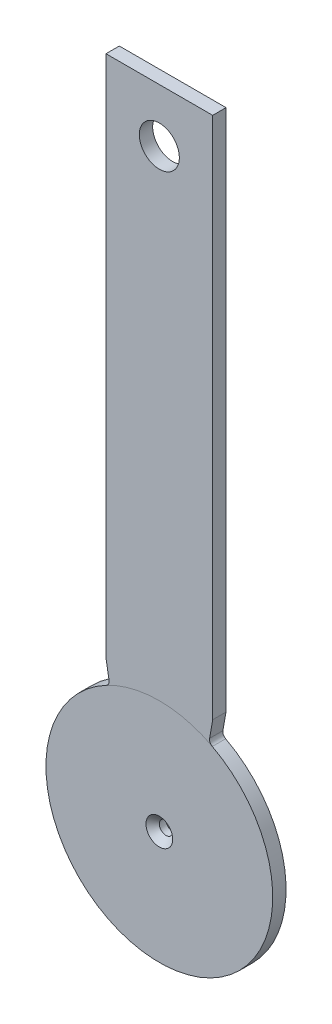
ISO-10303-21;
HEADER;
FILE_DESCRIPTION(('STEP AP214'),'2;1');
FILE_NAME('part.step','',(''),(''),'','','');
FILE_SCHEMA(('AUTOMOTIVE_DESIGN { 1 0 10303 214 1 1 1 1 }'));
ENDSEC;
DATA;
#1=APPLICATION_CONTEXT('core data for automotive mechanical design processes');
#2=APPLICATION_PROTOCOL_DEFINITION('international standard','automotive_design',2000,#1);
#3=PRODUCT_CONTEXT('',#1,'mechanical');
#4=PRODUCT('Part','Part','',(#3));
#5=PRODUCT_RELATED_PRODUCT_CATEGORY('part','',(#4));
#6=PRODUCT_DEFINITION_FORMATION('','',#4);
#7=PRODUCT_DEFINITION_CONTEXT('part definition',#1,'design');
#8=PRODUCT_DEFINITION('design','',#6,#7);
#9=PRODUCT_DEFINITION_SHAPE('','',#8);
#10=(LENGTH_UNIT() NAMED_UNIT(*) SI_UNIT(.MILLI.,.METRE.));
#11=(NAMED_UNIT(*) PLANE_ANGLE_UNIT() SI_UNIT($,.RADIAN.));
#12=(NAMED_UNIT(*) SI_UNIT($,.STERADIAN.) SOLID_ANGLE_UNIT());
#13=UNCERTAINTY_MEASURE_WITH_UNIT(LENGTH_MEASURE(1.E-05),#10,'distance_accuracy_value','');
#14=(GEOMETRIC_REPRESENTATION_CONTEXT(3) GLOBAL_UNCERTAINTY_ASSIGNED_CONTEXT((#13)) GLOBAL_UNIT_ASSIGNED_CONTEXT((#10,
#11,#12)) REPRESENTATION_CONTEXT('',''));
#15=CARTESIAN_POINT('',(0.,0.,0.));
#16=DIRECTION('',(0.,0.,1.));
#17=DIRECTION('',(1.,0.,0.));
#18=AXIS2_PLACEMENT_3D('',#15,#16,#17);
#19=CARTESIAN_POINT('',(13.208,24.9806933900963,1.5875));
#20=DIRECTION('',(0.,0.,1.));
#21=DIRECTION('',(1.,0.,0.));
#22=AXIS2_PLACEMENT_3D('',#19,#20,#21);
#23=PLANE('',#22);
#24=CARTESIAN_POINT('',(0.,141.2875,1.5875));
#25=DIRECTION('',(0.,0.,1.));
#26=DIRECTION('',(1.,0.,0.));
#27=AXIS2_PLACEMENT_3D('',#24,#25,#26);
#28=CIRCLE('',#27,4.76249999999999);
#29=CARTESIAN_POINT('',(4.76249999999999,141.2875,1.5875));
#30=VERTEX_POINT('',#29);
#31=EDGE_CURVE('E124',#30,#30,#28,.T.);
#32=ORIENTED_EDGE('',*,*,#31,.F.);
#33=EDGE_LOOP('',(#32));
#34=FACE_BOUND('',#33,.T.);
#35=CARTESIAN_POINT('',(-13.208,24.9806933900963,1.5875));
#36=DIRECTION('',(0.,0.,-1.));
#37=DIRECTION('',(-1.,0.,0.));
#38=AXIS2_PLACEMENT_3D('',#35,#36,#37);
#39=CIRCLE('',#38,1.27);
#40=CARTESIAN_POINT('',(-11.9572941536745,25.2012265757333,1.5875));
#41=VERTEX_POINT('',#40);
#42=CARTESIAN_POINT('',(-12.6143820224719,23.857965597283,1.5875));
#43=VERTEX_POINT('',#42);
#44=EDGE_CURVE('E136',#41,#43,#39,.T.);
#45=ORIENTED_EDGE('',*,*,#44,.T.);
#46=CARTESIAN_POINT('',(0.,0.,1.5875));
#47=DIRECTION('',(0.,0.,1.));
#48=DIRECTION('',(1.,0.,0.));
#49=AXIS2_PLACEMENT_3D('',#46,#47,#48);
#50=CIRCLE('',#49,26.9875);
#51=CARTESIAN_POINT('',(12.6143820224719,23.857965597283,1.5875));
#52=VERTEX_POINT('',#51);
#53=EDGE_CURVE('E11',#43,#52,#50,.F.);
#54=ORIENTED_EDGE('',*,*,#53,.T.);
#55=CARTESIAN_POINT('',(13.208,24.9806933900963,1.5875));
#56=DIRECTION('',(0.,0.,-1.));
#57=DIRECTION('',(1.,0.,0.));
#58=AXIS2_PLACEMENT_3D('',#55,#56,#57);
#59=CIRCLE('',#58,1.27);
#60=CARTESIAN_POINT('',(11.9572941536745,25.2012265757333,1.5875));
#61=VERTEX_POINT('',#60);
#62=EDGE_CURVE('E123',#52,#61,#59,.T.);
#63=ORIENTED_EDGE('',*,*,#62,.T.);
#64=DIRECTION('',(0.173648177666931,0.984807753012208,0.));
#65=VECTOR('',#64,1.);
#66=CARTESIAN_POINT('',(12.7,29.4133207393231,1.5875));
#67=LINE('',#66,#65);
#68=CARTESIAN_POINT('',(12.7,29.4133207393231,1.5875));
#69=VERTEX_POINT('',#68);
#70=EDGE_CURVE('E104',#61,#69,#67,.T.);
#71=ORIENTED_EDGE('',*,*,#70,.T.);
#72=DIRECTION('',(0.,1.,0.));
#73=VECTOR('',#72,1.);
#74=CARTESIAN_POINT('',(12.7,153.9875,1.5875));
#75=LINE('',#74,#73);
#76=CARTESIAN_POINT('',(12.7,153.9875,1.5875));
#77=VERTEX_POINT('',#76);
#78=EDGE_CURVE('E113',#69,#77,#75,.T.);
#79=ORIENTED_EDGE('',*,*,#78,.T.);
#80=DIRECTION('',(-1.,0.,0.));
#81=VECTOR('',#80,1.);
#82=CARTESIAN_POINT('',(-12.7,153.9875,1.5875));
#83=LINE('',#82,#81);
#84=CARTESIAN_POINT('',(-12.7,153.9875,1.5875));
#85=VERTEX_POINT('',#84);
#86=EDGE_CURVE('E118',#77,#85,#83,.T.);
#87=ORIENTED_EDGE('',*,*,#86,.T.);
#88=DIRECTION('',(0.,-1.,0.));
#89=VECTOR('',#88,1.);
#90=CARTESIAN_POINT('',(-12.7,29.4133207393231,1.5875));
#91=LINE('',#90,#89);
#92=CARTESIAN_POINT('',(-12.7,29.4133207393231,1.5875));
#93=VERTEX_POINT('',#92);
#94=EDGE_CURVE('E130',#85,#93,#91,.T.);
#95=ORIENTED_EDGE('',*,*,#94,.T.);
#96=DIRECTION('',(0.173648177666923,-0.984807753012209,0.));
#97=VECTOR('',#96,1.);
#98=CARTESIAN_POINT('',(-12.7,29.4133207393231,1.5875));
#99=LINE('',#98,#97);
#100=EDGE_CURVE('E133',#93,#41,#99,.T.);
#101=ORIENTED_EDGE('',*,*,#100,.T.);
#102=EDGE_LOOP('',(#45,#54,#63,#71,#79,#87,#95,#101));
#103=FACE_BOUND('',#102,.T.);
#104=ADVANCED_FACE('F38',(#34,#103),#23,.T.);
#105=CARTESIAN_POINT('',(13.208,24.9806933900963,-1.5875));
#106=DIRECTION('',(0.,0.,1.));
#107=DIRECTION('',(1.,0.,0.));
#108=AXIS2_PLACEMENT_3D('',#105,#106,#107);
#109=PLANE('',#108);
#110=CARTESIAN_POINT('',(0.,141.2875,-1.5875));
#111=DIRECTION('',(0.,0.,1.));
#112=DIRECTION('',(1.,0.,0.));
#113=AXIS2_PLACEMENT_3D('',#110,#111,#112);
#114=CIRCLE('',#113,4.76249999999999);
#115=CARTESIAN_POINT('',(4.76249999999999,141.2875,-1.5875));
#116=VERTEX_POINT('',#115);
#117=EDGE_CURVE('E142',#116,#116,#114,.T.);
#118=ORIENTED_EDGE('',*,*,#117,.T.);
#119=EDGE_LOOP('',(#118));
#120=FACE_BOUND('',#119,.T.);
#121=CARTESIAN_POINT('',(0.,0.,-1.5875));
#122=DIRECTION('',(0.,0.,1.));
#123=DIRECTION('',(1.,0.,0.));
#124=AXIS2_PLACEMENT_3D('',#121,#122,#123);
#125=CIRCLE('',#124,26.9875);
#126=CARTESIAN_POINT('',(-12.6143820224719,23.857965597283,-1.5875));
#127=VERTEX_POINT('',#126);
#128=CARTESIAN_POINT('',(12.6143820224719,23.857965597283,-1.5875));
#129=VERTEX_POINT('',#128);
#130=EDGE_CURVE('E42',#127,#129,#125,.F.);
#131=ORIENTED_EDGE('',*,*,#130,.F.);
#132=CARTESIAN_POINT('',(-13.208,24.9806933900963,-1.5875));
#133=DIRECTION('',(0.,0.,-1.));
#134=DIRECTION('',(-1.,0.,0.));
#135=AXIS2_PLACEMENT_3D('',#132,#133,#134);
#136=CIRCLE('',#135,1.27);
#137=CARTESIAN_POINT('',(-11.9572941536745,25.2012265757333,-1.5875));
#138=VERTEX_POINT('',#137);
#139=EDGE_CURVE('E160',#138,#127,#136,.T.);
#140=ORIENTED_EDGE('',*,*,#139,.F.);
#141=DIRECTION('',(0.173648177666923,-0.984807753012209,0.));
#142=VECTOR('',#141,1.);
#143=CARTESIAN_POINT('',(-12.7,29.4133207393231,-1.5875));
#144=LINE('',#143,#142);
#145=CARTESIAN_POINT('',(-12.7,29.4133207393231,-1.5875));
#146=VERTEX_POINT('',#145);
#147=EDGE_CURVE('E157',#146,#138,#144,.T.);
#148=ORIENTED_EDGE('',*,*,#147,.F.);
#149=DIRECTION('',(0.,-1.,0.));
#150=VECTOR('',#149,1.);
#151=CARTESIAN_POINT('',(-12.7,29.4133207393231,-1.5875));
#152=LINE('',#151,#150);
#153=CARTESIAN_POINT('',(-12.7,153.9875,-1.5875));
#154=VERTEX_POINT('',#153);
#155=EDGE_CURVE('E154',#154,#146,#152,.T.);
#156=ORIENTED_EDGE('',*,*,#155,.F.);
#157=DIRECTION('',(-1.,0.,0.));
#158=VECTOR('',#157,1.);
#159=CARTESIAN_POINT('',(-12.7,153.9875,-1.5875));
#160=LINE('',#159,#158);
#161=CARTESIAN_POINT('',(12.7,153.9875,-1.5875));
#162=VERTEX_POINT('',#161);
#163=EDGE_CURVE('E151',#162,#154,#160,.T.);
#164=ORIENTED_EDGE('',*,*,#163,.F.);
#165=DIRECTION('',(0.,1.,0.));
#166=VECTOR('',#165,1.);
#167=CARTESIAN_POINT('',(12.7,153.9875,-1.5875));
#168=LINE('',#167,#166);
#169=CARTESIAN_POINT('',(12.7,29.4133207393231,-1.5875));
#170=VERTEX_POINT('',#169);
#171=EDGE_CURVE('E149',#170,#162,#168,.T.);
#172=ORIENTED_EDGE('',*,*,#171,.F.);
#173=DIRECTION('',(0.173648177666931,0.984807753012208,0.));
#174=VECTOR('',#173,1.);
#175=CARTESIAN_POINT('',(12.7,29.4133207393231,-1.5875));
#176=LINE('',#175,#174);
#177=CARTESIAN_POINT('',(11.9572941536745,25.2012265757333,-1.5875));
#178=VERTEX_POINT('',#177);
#179=EDGE_CURVE('E105',#178,#170,#176,.T.);
#180=ORIENTED_EDGE('',*,*,#179,.F.);
#181=CARTESIAN_POINT('',(13.208,24.9806933900963,-1.5875));
#182=DIRECTION('',(0.,0.,-1.));
#183=DIRECTION('',(1.,0.,0.));
#184=AXIS2_PLACEMENT_3D('',#181,#182,#183);
#185=CIRCLE('',#184,1.27);
#186=EDGE_CURVE('E110',#129,#178,#185,.T.);
#187=ORIENTED_EDGE('',*,*,#186,.F.);
#188=EDGE_LOOP('',(#131,#140,#148,#156,#164,#172,#180,#187));
#189=FACE_BOUND('',#188,.T.);
#190=ADVANCED_FACE('F210',(#120,#189),#109,.F.);
#191=CARTESIAN_POINT('',(12.7,29.4133207393231,-1.5875));
#192=DIRECTION('',(0.984807753012208,-0.173648177666931,0.));
#193=DIRECTION('',(0.173648177666931,0.984807753012208,0.));
#194=AXIS2_PLACEMENT_3D('',#191,#192,#193);
#195=PLANE('',#194);
#196=DIRECTION('',(0.,0.,1.));
#197=VECTOR('',#196,1.);
#198=CARTESIAN_POINT('',(12.7,29.4133207393231,-1.5875));
#199=LINE('',#198,#197);
#200=EDGE_CURVE('E100',#170,#69,#199,.T.);
#201=ORIENTED_EDGE('',*,*,#200,.T.);
#202=ORIENTED_EDGE('',*,*,#70,.F.);
#203=DIRECTION('',(0.,0.,1.));
#204=VECTOR('',#203,1.);
#205=CARTESIAN_POINT('',(11.9572941536745,25.2012265757333,-1.5875));
#206=LINE('',#205,#204);
#207=EDGE_CURVE('E54',#178,#61,#206,.T.);
#208=ORIENTED_EDGE('',*,*,#207,.F.);
#209=ORIENTED_EDGE('',*,*,#179,.T.);
#210=EDGE_LOOP('',(#201,#202,#208,#209));
#211=FACE_BOUND('',#210,.T.);
#212=ADVANCED_FACE('F102',(#211),#195,.T.);
#213=CARTESIAN_POINT('',(13.208,24.9806933900963,-1.5875));
#214=DIRECTION('',(0.,0.,1.));
#215=DIRECTION('',(1.,0.,0.));
#216=AXIS2_PLACEMENT_3D('',#213,#214,#215);
#217=CYLINDRICAL_SURFACE('',#216,1.27);
#218=ORIENTED_EDGE('',*,*,#207,.T.);
#219=ORIENTED_EDGE('',*,*,#62,.F.);
#220=DIRECTION('',(0.,0.,1.));
#221=VECTOR('',#220,1.);
#222=CARTESIAN_POINT('',(12.6143820224719,23.857965597283,-1.5875));
#223=LINE('',#222,#221);
#224=EDGE_CURVE('E170',#129,#52,#223,.T.);
#225=ORIENTED_EDGE('',*,*,#224,.F.);
#226=ORIENTED_EDGE('',*,*,#186,.T.);
#227=EDGE_LOOP('',(#218,#219,#225,#226));
#228=FACE_BOUND('',#227,.T.);
#229=ADVANCED_FACE('F231',(#228),#217,.F.);
#230=CARTESIAN_POINT('',(0.,0.,-1.5875));
#231=DIRECTION('',(0.,0.,1.));
#232=DIRECTION('',(1.,0.,0.));
#233=AXIS2_PLACEMENT_3D('',#230,#231,#232);
#234=CYLINDRICAL_SURFACE('',#233,26.9875);
#235=ORIENTED_EDGE('',*,*,#224,.T.);
#236=CARTESIAN_POINT('',(0.,0.,1.5875));
#237=DIRECTION('',(0.,0.,1.));
#238=DIRECTION('',(1.,0.,0.));
#239=AXIS2_PLACEMENT_3D('',#236,#237,#238);
#240=CIRCLE('',#239,26.9875);
#241=EDGE_CURVE('E138',#43,#52,#240,.T.);
#242=ORIENTED_EDGE('',*,*,#241,.F.);
#243=DIRECTION('',(0.,0.,1.));
#244=VECTOR('',#243,1.);
#245=CARTESIAN_POINT('',(-12.6143820224719,23.857965597283,-1.5875));
#246=LINE('',#245,#244);
#247=EDGE_CURVE('E173',#127,#43,#246,.T.);
#248=ORIENTED_EDGE('',*,*,#247,.F.);
#249=CARTESIAN_POINT('',(0.,0.,-1.5875));
#250=DIRECTION('',(0.,0.,1.));
#251=DIRECTION('',(1.,0.,0.));
#252=AXIS2_PLACEMENT_3D('',#249,#250,#251);
#253=CIRCLE('',#252,26.9875);
#254=EDGE_CURVE('E163',#127,#129,#253,.T.);
#255=ORIENTED_EDGE('',*,*,#254,.T.);
#256=EDGE_LOOP('',(#235,#242,#248,#255));
#257=FACE_BOUND('',#256,.T.);
#258=ADVANCED_FACE('F233',(#257),#234,.T.);
#259=CARTESIAN_POINT('',(-13.208,24.9806933900963,-1.5875));
#260=DIRECTION('',(0.,0.,1.));
#261=DIRECTION('',(1.,0.,0.));
#262=AXIS2_PLACEMENT_3D('',#259,#260,#261);
#263=CYLINDRICAL_SURFACE('',#262,1.27);
#264=ORIENTED_EDGE('',*,*,#247,.T.);
#265=ORIENTED_EDGE('',*,*,#44,.F.);
#266=DIRECTION('',(0.,0.,1.));
#267=VECTOR('',#266,1.);
#268=CARTESIAN_POINT('',(-11.9572941536745,25.2012265757333,-1.5875));
#269=LINE('',#268,#267);
#270=EDGE_CURVE('E176',#138,#41,#269,.T.);
#271=ORIENTED_EDGE('',*,*,#270,.F.);
#272=ORIENTED_EDGE('',*,*,#139,.T.);
#273=EDGE_LOOP('',(#264,#265,#271,#272));
#274=FACE_BOUND('',#273,.T.);
#275=ADVANCED_FACE('F216',(#274),#263,.F.);
#276=CARTESIAN_POINT('',(-12.7,29.4133207393231,-1.5875));
#277=DIRECTION('',(-0.984807753012209,-0.173648177666923,0.));
#278=DIRECTION('',(0.173648177666923,-0.98480775301221,0.));
#279=AXIS2_PLACEMENT_3D('',#276,#277,#278);
#280=PLANE('',#279);
#281=ORIENTED_EDGE('',*,*,#270,.T.);
#282=ORIENTED_EDGE('',*,*,#100,.F.);
#283=DIRECTION('',(0.,0.,1.));
#284=VECTOR('',#283,1.);
#285=CARTESIAN_POINT('',(-12.7,29.4133207393231,-1.5875));
#286=LINE('',#285,#284);
#287=EDGE_CURVE('E178',#146,#93,#286,.T.);
#288=ORIENTED_EDGE('',*,*,#287,.F.);
#289=ORIENTED_EDGE('',*,*,#147,.T.);
#290=EDGE_LOOP('',(#281,#282,#288,#289));
#291=FACE_BOUND('',#290,.T.);
#292=ADVANCED_FACE('F222',(#291),#280,.T.);
#293=CARTESIAN_POINT('',(-12.7,29.4133207393231,-1.5875));
#294=DIRECTION('',(-1.,0.,0.));
#295=DIRECTION('',(0.,0.,1.));
#296=AXIS2_PLACEMENT_3D('',#293,#294,#295);
#297=PLANE('',#296);
#298=ORIENTED_EDGE('',*,*,#287,.T.);
#299=ORIENTED_EDGE('',*,*,#94,.F.);
#300=DIRECTION('',(0.,0.,1.));
#301=VECTOR('',#300,1.);
#302=CARTESIAN_POINT('',(-12.7,153.9875,-1.5875));
#303=LINE('',#302,#301);
#304=EDGE_CURVE('E180',#154,#85,#303,.T.);
#305=ORIENTED_EDGE('',*,*,#304,.F.);
#306=ORIENTED_EDGE('',*,*,#155,.T.);
#307=EDGE_LOOP('',(#298,#299,#305,#306));
#308=FACE_BOUND('',#307,.T.);
#309=ADVANCED_FACE('F226',(#308),#297,.T.);
#310=CARTESIAN_POINT('',(-12.7,153.9875,-1.5875));
#311=DIRECTION('',(0.,1.,0.));
#312=DIRECTION('',(0.,0.,1.));
#313=AXIS2_PLACEMENT_3D('',#310,#311,#312);
#314=PLANE('',#313);
#315=ORIENTED_EDGE('',*,*,#304,.T.);
#316=ORIENTED_EDGE('',*,*,#86,.F.);
#317=DIRECTION('',(0.,0.,1.));
#318=VECTOR('',#317,1.);
#319=CARTESIAN_POINT('',(12.7,153.9875,-1.5875));
#320=LINE('',#319,#318);
#321=EDGE_CURVE('E109',#162,#77,#320,.T.);
#322=ORIENTED_EDGE('',*,*,#321,.F.);
#323=ORIENTED_EDGE('',*,*,#163,.T.);
#324=EDGE_LOOP('',(#315,#316,#322,#323));
#325=FACE_BOUND('',#324,.T.);
#326=ADVANCED_FACE('F228',(#325),#314,.T.);
#327=CARTESIAN_POINT('',(12.7,153.9875,-1.5875));
#328=DIRECTION('',(1.,0.,0.));
#329=DIRECTION('',(0.,1.,0.));
#330=AXIS2_PLACEMENT_3D('',#327,#328,#329);
#331=PLANE('',#330);
#332=ORIENTED_EDGE('',*,*,#321,.T.);
#333=ORIENTED_EDGE('',*,*,#78,.F.);
#334=ORIENTED_EDGE('',*,*,#200,.F.);
#335=ORIENTED_EDGE('',*,*,#171,.T.);
#336=EDGE_LOOP('',(#332,#333,#334,#335));
#337=FACE_BOUND('',#336,.T.);
#338=ADVANCED_FACE('F114',(#337),#331,.T.);
#339=CARTESIAN_POINT('',(0.,0.,-1.5875));
#340=DIRECTION('',(0.,0.,1.));
#341=DIRECTION('',(1.,0.,0.));
#342=AXIS2_PLACEMENT_3D('',#339,#340,#341);
#343=CIRCLE('',#342,1.5875);
#344=CARTESIAN_POINT('',(1.5875,0.,-1.5875));
#345=VERTEX_POINT('',#344);
#346=EDGE_CURVE('E145',#345,#345,#343,.T.);
#347=ORIENTED_EDGE('',*,*,#346,.T.);
#348=EDGE_LOOP('',(#347));
#349=FACE_BOUND('',#348,.T.);
#350=ORIENTED_EDGE('',*,*,#254,.F.);
#351=ORIENTED_EDGE('',*,*,#130,.T.);
#352=EDGE_LOOP('',(#350,#351));
#353=FACE_BOUND('',#352,.T.);
#354=ADVANCED_FACE('F204',(#349,#353),#109,.F.);
#355=CARTESIAN_POINT('',(0.,0.,-1.5875));
#356=DIRECTION('',(0.,0.,1.));
#357=DIRECTION('',(1.,0.,0.));
#358=AXIS2_PLACEMENT_3D('',#355,#356,#357);
#359=CYLINDRICAL_SURFACE('',#358,1.5875);
#360=CARTESIAN_POINT('',(0.,0.,0.));
#361=DIRECTION('',(0.,0.,1.));
#362=DIRECTION('',(1.,0.,0.));
#363=AXIS2_PLACEMENT_3D('',#360,#361,#362);
#364=CIRCLE('',#363,1.5875);
#365=CARTESIAN_POINT('',(1.5875,0.,0.));
#366=VERTEX_POINT('',#365);
#367=EDGE_CURVE('E169',#366,#366,#364,.T.);
#368=ORIENTED_EDGE('',*,*,#367,.T.);
#369=EDGE_LOOP('',(#368));
#370=FACE_BOUND('',#369,.T.);
#371=ORIENTED_EDGE('',*,*,#346,.F.);
#372=EDGE_LOOP('',(#371));
#373=FACE_BOUND('',#372,.T.);
#374=ADVANCED_FACE('F200',(#370,#373),#359,.F.);
#375=CARTESIAN_POINT('',(0.,141.2875,-1.5875));
#376=DIRECTION('',(0.,0.,1.));
#377=DIRECTION('',(1.,0.,0.));
#378=AXIS2_PLACEMENT_3D('',#375,#376,#377);
#379=CYLINDRICAL_SURFACE('',#378,4.76249999999999);
#380=ORIENTED_EDGE('',*,*,#117,.F.);
#381=EDGE_LOOP('',(#380));
#382=FACE_BOUND('',#381,.T.);
#383=ORIENTED_EDGE('',*,*,#31,.T.);
#384=EDGE_LOOP('',(#383));
#385=FACE_BOUND('',#384,.T.);
#386=ADVANCED_FACE('F203',(#382,#385),#379,.F.);
#387=ORIENTED_EDGE('',*,*,#53,.F.);
#388=ORIENTED_EDGE('',*,*,#241,.T.);
#389=EDGE_LOOP('',(#387,#388));
#390=FACE_BOUND('',#389,.T.);
#391=CARTESIAN_POINT('',(0.,0.,1.5875));
#392=DIRECTION('',(0.,0.,1.));
#393=DIRECTION('',(1.,0.,0.));
#394=AXIS2_PLACEMENT_3D('',#391,#392,#393);
#395=CIRCLE('',#394,3.17500000000004);
#396=CARTESIAN_POINT('',(3.17500000000004,0.,1.5875));
#397=VERTEX_POINT('',#396);
#398=EDGE_CURVE('E185',#397,#397,#395,.F.);
#399=ORIENTED_EDGE('',*,*,#398,.T.);
#400=EDGE_LOOP('',(#399));
#401=FACE_BOUND('',#400,.T.);
#402=ADVANCED_FACE('F194',(#390,#401),#23,.T.);
#403=CARTESIAN_POINT('',(0.,0.,0.));
#404=DIRECTION('',(0.,0.,1.));
#405=DIRECTION('',(1.,0.,0.));
#406=AXIS2_PLACEMENT_3D('',#403,#404,#405);
#407=CONICAL_SURFACE('',#406,1.5875,0.785398163397447);
#408=CARTESIAN_POINT('',(3.17500000000004,0.,1.5875));
#409=CARTESIAN_POINT('',(3.15846354166671,0.,1.57096354166667));
#410=CARTESIAN_POINT('',(3.14192708333337,0.,1.55442708333333));
#411=CARTESIAN_POINT('',(3.1088541666667,0.,1.52135416666666));
#412=CARTESIAN_POINT('',(3.09231770833337,0.,1.50481770833333));
#413=CARTESIAN_POINT('',(3.0592447916667,0.,1.47174479166666));
#414=CARTESIAN_POINT('',(3.04270833333337,0.,1.45520833333333));
#415=CARTESIAN_POINT('',(3.0096354166667,0.,1.42213541666666));
#416=CARTESIAN_POINT('',(2.99309895833337,0.,1.40559895833333));
#417=CARTESIAN_POINT('',(2.9600260416667,0.,1.37252604166666));
#418=CARTESIAN_POINT('',(2.94348958333337,0.,1.35598958333333));
#419=CARTESIAN_POINT('',(2.9104166666667,0.,1.32291666666666));
#420=CARTESIAN_POINT('',(2.89388020833337,0.,1.30638020833333));
#421=CARTESIAN_POINT('',(2.8608072916667,0.,1.27330729166666));
#422=CARTESIAN_POINT('',(2.84427083333336,0.,1.25677083333332));
#423=CARTESIAN_POINT('',(2.8111979166667,0.,1.22369791666666));
#424=CARTESIAN_POINT('',(2.79466145833336,0.,1.20716145833332));
#425=CARTESIAN_POINT('',(2.7615885416667,0.,1.17408854166665));
#426=CARTESIAN_POINT('',(2.74505208333336,0.,1.15755208333332));
#427=CARTESIAN_POINT('',(2.71197916666669,0.,1.12447916666665));
#428=CARTESIAN_POINT('',(2.69544270833336,0.,1.10794270833332));
#429=CARTESIAN_POINT('',(2.66236979166669,0.,1.07486979166665));
#430=CARTESIAN_POINT('',(2.64583333333336,0.,1.05833333333332));
#431=CARTESIAN_POINT('',(2.61276041666669,0.,1.02526041666665));
#432=CARTESIAN_POINT('',(2.59622395833336,0.,1.00872395833332));
#433=CARTESIAN_POINT('',(2.56315104166669,0.,0.975651041666649));
#434=CARTESIAN_POINT('',(2.54661458333336,0.,0.959114583333316));
#435=CARTESIAN_POINT('',(2.51354166666669,0.,0.926041666666648));
#436=CARTESIAN_POINT('',(2.49700520833336,0.,0.909505208333314));
#437=CARTESIAN_POINT('',(2.46393229166669,0.,0.876432291666646));
#438=CARTESIAN_POINT('',(2.44739583333335,0.,0.859895833333313));
#439=CARTESIAN_POINT('',(2.41432291666669,0.,0.826822916666645));
#440=CARTESIAN_POINT('',(2.39778645833335,0.,0.810286458333311));
#441=CARTESIAN_POINT('',(2.36471354166669,0.,0.777213541666644));
#442=CARTESIAN_POINT('',(2.34817708333335,0.,0.76067708333331));
#443=CARTESIAN_POINT('',(2.31510416666668,0.,0.727604166666642));
#444=CARTESIAN_POINT('',(2.29856770833335,0.,0.711067708333308));
#445=CARTESIAN_POINT('',(2.26549479166668,0.,0.677994791666641));
#446=CARTESIAN_POINT('',(2.24895833333335,0.,0.661458333333307));
#447=CARTESIAN_POINT('',(2.21588541666668,0.,0.628385416666639));
#448=CARTESIAN_POINT('',(2.19934895833335,0.,0.611848958333306));
#449=CARTESIAN_POINT('',(2.16627604166668,0.,0.578776041666638));
#450=CARTESIAN_POINT('',(2.14973958333335,0.,0.562239583333304));
#451=CARTESIAN_POINT('',(2.11666666666668,0.,0.529166666666637));
#452=CARTESIAN_POINT('',(2.10013020833335,0.,0.512630208333303));
#453=CARTESIAN_POINT('',(2.06705729166668,0.,0.479557291666635));
#454=CARTESIAN_POINT('',(2.05052083333334,0.,0.463020833333301));
#455=CARTESIAN_POINT('',(2.01744791666668,0.,0.429947916666634));
#456=CARTESIAN_POINT('',(2.00091145833334,0.,0.4134114583333));
#457=CARTESIAN_POINT('',(1.96783854166668,0.,0.380338541666633));
#458=CARTESIAN_POINT('',(1.95130208333334,0.,0.363802083333299));
#459=CARTESIAN_POINT('',(1.91822916666667,0.,0.330729166666631));
#460=CARTESIAN_POINT('',(1.90169270833334,0.,0.314192708333297));
#461=CARTESIAN_POINT('',(1.86861979166667,0.,0.28111979166663));
#462=CARTESIAN_POINT('',(1.85208333333334,0.,0.264583333333296));
#463=CARTESIAN_POINT('',(1.81901041666667,0.,0.231510416666628));
#464=CARTESIAN_POINT('',(1.80247395833334,0.,0.214973958333294));
#465=CARTESIAN_POINT('',(1.76940104166667,0.,0.181901041666627));
#466=CARTESIAN_POINT('',(1.75286458333334,0.,0.165364583333293));
#467=CARTESIAN_POINT('',(1.71979166666667,0.,0.132291666666626));
#468=CARTESIAN_POINT('',(1.70325520833334,0.,0.115755208333292));
#469=CARTESIAN_POINT('',(1.67018229166667,0.,0.0826822916666241));
#470=CARTESIAN_POINT('',(1.65364583333333,0.,0.0661458333332903));
#471=CARTESIAN_POINT('',(1.62057291666667,0.,0.0330729166666228));
#472=CARTESIAN_POINT('',(1.60403645833333,0.,0.0165364583332889));
#473=CARTESIAN_POINT('',(1.5875,0.,0.));
#474=B_SPLINE_CURVE_WITH_KNOTS('',3,(#408,#409,#410,#411,#412,#413,#414,#415,#416,#417,#418,
#419,#420,#421,#422,#423,#424,#425,#426,#427,#428,#429,#430,#431,#432,#433,#434,#435,#436,#437,
#438,#439,#440,#441,#442,#443,#444,#445,#446,#447,#448,#449,#450,#451,#452,#453,#454,#455,#456,
#457,#458,#459,#460,#461,#462,#463,#464,#465,#466,#467,#468,#469,#470,#471,#472,#473),
.UNSPECIFIED.,.F.,.F.,(4,2,2,2,2,2,2,2,2,2,2,2,2,2,2,2,2,2,2,2,2,2,2,2,2,2,2,2,2,2,2,2,4),(0.,
0.0701582509458545,0.140316501891709,0.210474752837564,0.280633003783418,0.350791254729273,
0.420949505675128,0.491107756620982,0.561266007566837,0.631424258512691,0.701582509458546,
0.771740760404401,0.841899011350255,0.91205726229611,0.982215513241964,1.05237376418782,
1.12253201513367,1.19269026607953,1.26284851702538,1.33300676797124,1.40316501891709,
1.47332326986295,1.5434815208088,1.61363977175466,1.68379802270051,1.75395627364637,
1.82411452459222,1.89427277553807,1.96443102648393,2.03458927742978,2.10474752837564,
2.17490577932149,2.24506403026735),.UNSPECIFIED.);
#475=EDGE_CURVE('BSEAM40',#397,#366,#474,.T.);
#476=ORIENTED_EDGE('',*,*,#398,.F.);
#477=ORIENTED_EDGE('',*,*,#367,.F.);
#478=ORIENTED_EDGE('',*,*,#475,.T.);
#479=ORIENTED_EDGE('',*,*,#475,.F.);
#480=EDGE_LOOP('',(#476,#478,#477,#479));
#481=FACE_BOUND('',#480,.T.);
#482=ADVANCED_FACE('F40',(#481),#407,.F.);
#483=CLOSED_SHELL('',(#104,#190,#212,#229,#258,#275,#292,#309,#326,#338,#354,#374,#386,#402,#482));
#484=MANIFOLD_SOLID_BREP('B2',#483);
#485=ADVANCED_BREP_SHAPE_REPRESENTATION('',(#18,#484),#14);
#486=SHAPE_DEFINITION_REPRESENTATION(#9,#485);
ENDSEC;
END-ISO-10303-21;
